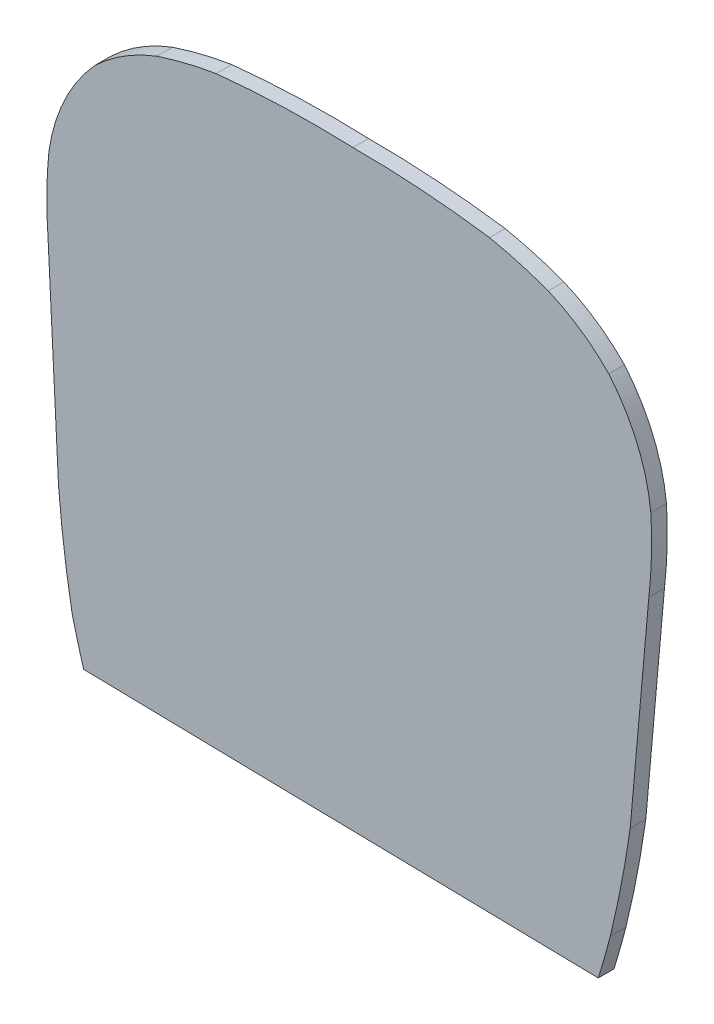
ISO-10303-21;
HEADER;
FILE_DESCRIPTION(('STEP AP214'),'2;1');
FILE_NAME('part.step','',(''),(''),'','','');
FILE_SCHEMA(('AUTOMOTIVE_DESIGN { 1 0 10303 214 1 1 1 1 }'));
ENDSEC;
DATA;
#1=APPLICATION_CONTEXT('core data for automotive mechanical design processes');
#2=APPLICATION_PROTOCOL_DEFINITION('international standard','automotive_design',2000,#1);
#3=PRODUCT_CONTEXT('',#1,'mechanical');
#4=PRODUCT('Part','Part','',(#3));
#5=PRODUCT_RELATED_PRODUCT_CATEGORY('part','',(#4));
#6=PRODUCT_DEFINITION_FORMATION('','',#4);
#7=PRODUCT_DEFINITION_CONTEXT('part definition',#1,'design');
#8=PRODUCT_DEFINITION('design','',#6,#7);
#9=PRODUCT_DEFINITION_SHAPE('','',#8);
#10=(LENGTH_UNIT() NAMED_UNIT(*) SI_UNIT(.MILLI.,.METRE.));
#11=(NAMED_UNIT(*) PLANE_ANGLE_UNIT() SI_UNIT($,.RADIAN.));
#12=(NAMED_UNIT(*) SI_UNIT($,.STERADIAN.) SOLID_ANGLE_UNIT());
#13=UNCERTAINTY_MEASURE_WITH_UNIT(LENGTH_MEASURE(1.E-05),#10,'distance_accuracy_value','');
#14=(GEOMETRIC_REPRESENTATION_CONTEXT(3) GLOBAL_UNCERTAINTY_ASSIGNED_CONTEXT((#13)) GLOBAL_UNIT_ASSIGNED_CONTEXT((#10,
#11,#12)) REPRESENTATION_CONTEXT('',''));
#15=CARTESIAN_POINT('',(0.,0.,0.));
#16=DIRECTION('',(0.,0.,1.));
#17=DIRECTION('',(1.,0.,0.));
#18=AXIS2_PLACEMENT_3D('',#15,#16,#17);
#19=CARTESIAN_POINT('',(-5.67417224383373,6.99934325123754,45.8150965279296));
#20=DIRECTION('',(0.,0.,1.));
#21=DIRECTION('',(-0.999812677663925,0.0193548335692306,0.));
#22=AXIS2_PLACEMENT_3D('',#19,#20,#21);
#23=PLANE('',#22);
#24=CARTESIAN_POINT('',(0.530056286970287,1.01824527478446,45.8150965279299));
#25=DIRECTION('',(0.,0.,-1.));
#26=DIRECTION('',(0.999812677663925,-0.0193548335692306,0.));
#27=AXIS2_PLACEMENT_3D('',#24,#25,#26);
#28=CIRCLE('',#27,12.0325225140272);
#29=CARTESIAN_POINT('',(2.90017532436274,12.8150301672525,45.8150965279298));
#30=VERTEX_POINT('',#29);
#31=CARTESIAN_POINT('',(4.78161682306448,12.2746137415013,45.8150965279299));
#32=VERTEX_POINT('',#31);
#33=EDGE_CURVE('E252',#30,#32,#28,.T.);
#34=ORIENTED_EDGE('',*,*,#33,.F.);
#35=CARTESIAN_POINT('',(-1.48641653317343,-17.9871033769043,45.8150965279301));
#36=DIRECTION('',(0.,0.,-1.));
#37=DIRECTION('',(0.999812677663925,-0.0193548335692306,0.));
#38=AXIS2_PLACEMENT_3D('',#35,#36,#37);
#39=CIRCLE('',#38,31.1129172370042);
#40=CARTESIAN_POINT('',(-1.47338446078643,13.1258111307685,45.8150965279297));
#41=VERTEX_POINT('',#40);
#42=EDGE_CURVE('E247',#41,#30,#39,.T.);
#43=ORIENTED_EDGE('',*,*,#42,.F.);
#44=CARTESIAN_POINT('',(-2.66450711215649,-17.9642973237393,45.8150965279301));
#45=DIRECTION('',(0.,0.,-1.));
#46=DIRECTION('',(0.999812677663925,-0.0193548335692306,0.));
#47=AXIS2_PLACEMENT_3D('',#44,#45,#46);
#48=CIRCLE('',#47,31.1129172030472);
#49=CARTESIAN_POINT('',(-5.85569546522282,12.9845303403083,45.8150965279296));
#50=VERTEX_POINT('',#49);
#51=EDGE_CURVE('E242',#50,#41,#48,.T.);
#52=ORIENTED_EDGE('',*,*,#51,.F.);
#53=CARTESIAN_POINT('',(-3.94391624226271,1.10485449232203,45.8150965279298));
#54=DIRECTION('',(0.,0.,-1.));
#55=DIRECTION('',(0.999812677663925,-0.0193548335692306,0.));
#56=AXIS2_PLACEMENT_3D('',#53,#54,#55);
#57=CIRCLE('',#56,12.0325225140272);
#58=CARTESIAN_POINT('',(-7.75664277320113,12.5173351363735,45.8150965279295));
#59=VERTEX_POINT('',#58);
#60=EDGE_CURVE('E237',#59,#50,#57,.T.);
#61=ORIENTED_EDGE('',*,*,#60,.F.);
#62=CARTESIAN_POINT('',(-5.67417224383373,6.99934325123754,45.8150965279296));
#63=DIRECTION('',(0.,0.,-1.));
#64=DIRECTION('',(0.999812677663925,-0.0193548335692306,0.));
#65=AXIS2_PLACEMENT_3D('',#62,#63,#64);
#66=CIRCLE('',#65,5.8978740195184);
#67=CARTESIAN_POINT('',(-9.74550957704439,11.2665590026749,45.8150965279295));
#68=VERTEX_POINT('',#67);
#69=EDGE_CURVE('E232',#68,#59,#66,.T.);
#70=ORIENTED_EDGE('',*,*,#69,.F.);
#71=CARTESIAN_POINT('',(-5.42512198701847,7.3272075898744,45.8150965279296));
#72=DIRECTION('',(0.,0.,-1.));
#73=DIRECTION('',(0.999812677663925,-0.0193548335692306,0.));
#74=AXIS2_PLACEMENT_3D('',#71,#72,#73);
#75=CIRCLE('',#74,5.846728870196);
#76=CARTESIAN_POINT('',(-11.2152036833306,8.13911425422368,45.8150965279295));
#77=VERTEX_POINT('',#76);
#78=EDGE_CURVE('E227',#77,#68,#75,.T.);
#79=ORIENTED_EDGE('',*,*,#78,.F.);
#80=CARTESIAN_POINT('',(2.30368448001543,6.79226722780302,45.8150965279299));
#81=DIRECTION('',(0.,0.,-1.));
#82=DIRECTION('',(0.999812677663925,-0.0193548335692306,0.));
#83=AXIS2_PLACEMENT_3D('',#80,#81,#82);
#84=CIRCLE('',#83,13.5858137071592);
#85=CARTESIAN_POINT('',(-11.2430688844002,5.76279776767875,45.8150965279295));
#86=VERTEX_POINT('',#85);
#87=EDGE_CURVE('E136',#86,#77,#84,.T.);
#88=ORIENTED_EDGE('',*,*,#87,.F.);
#89=DIRECTION('',(0.0500831809567751,-0.998745050042928,0.));
#90=VECTOR('',#89,1.);
#91=CARTESIAN_POINT('',(-10.9057934577918,-0.963056229434312,45.8150965279296));
#92=LINE('',#91,#90);
#93=CARTESIAN_POINT('',(-10.9057934577918,-0.963056229434231,45.8150965279296));
#94=VERTEX_POINT('',#93);
#95=EDGE_CURVE('E135',#94,#86,#92,.F.);
#96=ORIENTED_EDGE('',*,*,#95,.F.);
#97=CARTESIAN_POINT('',(22.6796627220154,1.7211664776255,45.8150965279306));
#98=DIRECTION('',(0.,0.,-1.));
#99=DIRECTION('',(0.999812677663925,-0.0193548335692306,0.));
#100=AXIS2_PLACEMENT_3D('',#97,#98,#99);
#101=CIRCLE('',#100,33.6925498938096);
#102=CARTESIAN_POINT('',(-10.4707169958812,-4.29882047469555,45.8150965279296));
#103=VERTEX_POINT('',#102);
#104=EDGE_CURVE('E20',#103,#94,#101,.T.);
#105=ORIENTED_EDGE('',*,*,#104,.F.);
#106=CARTESIAN_POINT('',(17.1662588400598,2.46523412556552,45.8150965279304));
#107=DIRECTION('',(0.,0.,-1.));
#108=DIRECTION('',(0.999812677663925,-0.0193548335692306,0.));
#109=AXIS2_PLACEMENT_3D('',#106,#107,#108);
#110=CIRCLE('',#109,28.4526776945808);
#111=CARTESIAN_POINT('',(-10.1003556820076,-5.6641324239686,45.8150965279297));
#112=VERTEX_POINT('',#111);
#113=EDGE_CURVE('E278',#112,#103,#110,.T.);
#114=ORIENTED_EDGE('',*,*,#113,.F.);
#115=DIRECTION('',(0.999812677663925,-0.0193548335692306,0.));
#116=VECTOR('',#115,1.);
#117=CARTESIAN_POINT('',(6.38510731119488,-5.98326559728529,45.8150965279302));
#118=LINE('',#117,#116);
#119=CARTESIAN_POINT('',(6.38510731119487,-5.98326559728529,45.8150965279302));
#120=VERTEX_POINT('',#119);
#121=EDGE_CURVE('E168',#120,#112,#118,.F.);
#122=ORIENTED_EDGE('',*,*,#121,.F.);
#123=CARTESIAN_POINT('',(-20.7843012620732,2.46529083387636,45.8150965279292));
#124=DIRECTION('',(0.,0.,-1.));
#125=DIRECTION('',(0.999812677663925,-0.0193548335692306,0.));
#126=AXIS2_PLACEMENT_3D('',#123,#124,#125);
#127=CIRCLE('',#126,28.4526776945808);
#128=CARTESIAN_POINT('',(6.76871470810026,-4.63303142839532,45.8150965279302));
#129=VERTEX_POINT('',#128);
#130=EDGE_CURVE('E275',#129,#120,#127,.T.);
#131=ORIENTED_EDGE('',*,*,#130,.F.);
#132=CARTESIAN_POINT('',(-25.9566044322497,3.38204221500296,45.8150965279291));
#133=DIRECTION('',(0.,0.,-1.));
#134=DIRECTION('',(0.999812677663925,-0.0193548335692306,0.));
#135=AXIS2_PLACEMENT_3D('',#132,#133,#134);
#136=CIRCLE('',#135,33.6925498938096);
#137=CARTESIAN_POINT('',(7.40687411566913,-1.31542705359407,45.8150965279302));
#138=VERTEX_POINT('',#137);
#139=EDGE_CURVE('E270',#138,#129,#136,.T.);
#140=ORIENTED_EDGE('',*,*,#139,.F.);
#141=DIRECTION('',(0.0886995040357044,0.996058431008854,0.));
#142=VECTOR('',#141,1.);
#143=CARTESIAN_POINT('',(8.00401392218934,5.39020388810814,45.8150965279301));
#144=LINE('',#143,#142);
#145=CARTESIAN_POINT('',(8.00401392218934,5.39020388810806,45.8150965279301));
#146=VERTEX_POINT('',#145);
#147=EDGE_CURVE('E162',#146,#138,#144,.F.);
#148=ORIENTED_EDGE('',*,*,#147,.F.);
#149=CARTESIAN_POINT('',(-5.49274699972552,6.94319413350787,45.8150965279296));
#150=DIRECTION('',(0.,0.,-1.));
#151=DIRECTION('',(0.999812677663925,-0.0193548335692306,0.));
#152=AXIS2_PLACEMENT_3D('',#149,#150,#151);
#153=CIRCLE('',#152,13.5858137071592);
#154=CARTESIAN_POINT('',(8.06813878736105,7.76581844340164,45.8150965279301));
#155=VERTEX_POINT('',#154);
#156=EDGE_CURVE('E267',#155,#146,#153,.T.);
#157=ORIENTED_EDGE('',*,*,#156,.F.);
#158=CARTESIAN_POINT('',(2.25097238178384,7.17861022529906,45.8150965279299));
#159=DIRECTION('',(0.,0.,-1.));
#160=DIRECTION('',(0.999812677663925,-0.0193548335692306,0.));
#161=AXIS2_PLACEMENT_3D('',#158,#159,#160);
#162=CIRCLE('',#161,5.846728870196);
#163=CARTESIAN_POINT('',(6.72058547159109,10.9478007629354,45.81509652793));
#164=VERTEX_POINT('',#163);
#165=EDGE_CURVE('E262',#164,#155,#162,.T.);
#166=ORIENTED_EDGE('',*,*,#165,.F.);
#167=CARTESIAN_POINT('',(2.48714690336352,6.84135268227571,45.8150965279299));
#168=DIRECTION('',(0.,0.,-1.));
#169=DIRECTION('',(0.999812677663925,-0.0193548335692306,0.));
#170=AXIS2_PLACEMENT_3D('',#167,#168,#169);
#171=CIRCLE('',#170,5.8978740195184);
#172=EDGE_CURVE('E257',#32,#164,#171,.T.);
#173=ORIENTED_EDGE('',*,*,#172,.F.);
#174=EDGE_LOOP('',(#34,#43,#52,#61,#70,#79,#88,#96,#105,#114,#122,#131,#140,#148,#157,#166,#173));
#175=FACE_BOUND('',#174,.T.);
#176=ADVANCED_FACE('F17',(#175),#23,.T.);
#177=CARTESIAN_POINT('',(-10.9057934577918,-0.963056229434297,46.8472492910314));
#178=DIRECTION('',(-0.998745050042928,-0.0500831809567751,0.));
#179=DIRECTION('',(0.0500831809567751,-0.998745050042928,0.));
#180=AXIS2_PLACEMENT_3D('',#177,#178,#179);
#181=PLANE('',#180);
#182=DIRECTION('',(0.,0.,-1.));
#183=VECTOR('',#182,1.);
#184=CARTESIAN_POINT('',(-10.9057934577918,-0.963056229434226,46.8472492910314));
#185=LINE('',#184,#183);
#186=CARTESIAN_POINT('',(-10.9057934577918,-0.963056229434252,45.3140965279296));
#187=VERTEX_POINT('',#186);
#188=EDGE_CURVE('E142',#94,#187,#185,.T.);
#189=ORIENTED_EDGE('',*,*,#188,.F.);
#190=ORIENTED_EDGE('',*,*,#95,.T.);
#191=DIRECTION('',(0.,0.,-1.));
#192=VECTOR('',#191,1.);
#193=CARTESIAN_POINT('',(-11.2430688844002,5.76279776767878,46.8472492910314));
#194=LINE('',#193,#192);
#195=CARTESIAN_POINT('',(-11.2430688844002,5.76279776767882,45.3140965279295));
#196=VERTEX_POINT('',#195);
#197=EDGE_CURVE('E226',#196,#86,#194,.F.);
#198=ORIENTED_EDGE('',*,*,#197,.F.);
#199=DIRECTION('',(0.050083180956776,-0.998745050042928,0.));
#200=VECTOR('',#199,1.);
#201=CARTESIAN_POINT('',(-11.2430688844002,5.76279776767876,45.3140965279295));
#202=LINE('',#201,#200);
#203=EDGE_CURVE('E154',#196,#187,#202,.T.);
#204=ORIENTED_EDGE('',*,*,#203,.T.);
#205=EDGE_LOOP('',(#189,#190,#198,#204));
#206=FACE_BOUND('',#205,.T.);
#207=ADVANCED_FACE('F152',(#206),#181,.T.);
#208=CARTESIAN_POINT('',(22.6796627220154,1.72116647762551,46.8472492910325));
#209=DIRECTION('',(0.,0.,-1.));
#210=DIRECTION('',(0.999812677663925,-0.0193548335692306,0.));
#211=AXIS2_PLACEMENT_3D('',#208,#209,#210);
#212=CYLINDRICAL_SURFACE('',#211,33.6925498938096);
#213=DIRECTION('',(0.,0.,-1.));
#214=VECTOR('',#213,1.);
#215=CARTESIAN_POINT('',(-10.4707169958812,-4.29882047469553,46.8472492910315));
#216=LINE('',#215,#214);
#217=CARTESIAN_POINT('',(-10.4707169958812,-4.29882047469555,45.3140965279297));
#218=VERTEX_POINT('',#217);
#219=EDGE_CURVE('E149',#103,#218,#216,.T.);
#220=ORIENTED_EDGE('',*,*,#219,.F.);
#221=ORIENTED_EDGE('',*,*,#104,.T.);
#222=ORIENTED_EDGE('',*,*,#188,.T.);
#223=CARTESIAN_POINT('',(22.6796627220154,1.72116647762549,45.3140965279306));
#224=DIRECTION('',(0.,0.,-1.));
#225=DIRECTION('',(0.999812677663925,-0.0193548335692306,0.));
#226=AXIS2_PLACEMENT_3D('',#223,#224,#225);
#227=CIRCLE('',#226,33.6925498938096);
#228=EDGE_CURVE('E221',#187,#218,#227,.F.);
#229=ORIENTED_EDGE('',*,*,#228,.T.);
#230=EDGE_LOOP('',(#220,#221,#222,#229));
#231=FACE_BOUND('',#230,.T.);
#232=ADVANCED_FACE('F146',(#231),#212,.T.);
#233=CARTESIAN_POINT('',(17.1662588400597,2.46523412556554,46.8472492910323));
#234=DIRECTION('',(0.,0.,-1.));
#235=DIRECTION('',(0.999812677663925,-0.0193548335692306,0.));
#236=AXIS2_PLACEMENT_3D('',#233,#234,#235);
#237=CYLINDRICAL_SURFACE('',#236,28.4526776945808);
#238=DIRECTION('',(0.,0.,1.));
#239=VECTOR('',#238,1.);
#240=CARTESIAN_POINT('',(-10.1003556820076,-5.66413242396858,46.8472492910315));
#241=LINE('',#240,#239);
#242=CARTESIAN_POINT('',(-10.1003556820075,-5.66413242396861,45.3140965279297));
#243=VERTEX_POINT('',#242);
#244=EDGE_CURVE('E172',#112,#243,#241,.F.);
#245=ORIENTED_EDGE('',*,*,#244,.F.);
#246=ORIENTED_EDGE('',*,*,#113,.T.);
#247=ORIENTED_EDGE('',*,*,#219,.T.);
#248=CARTESIAN_POINT('',(17.1662588400598,2.46523412556551,45.3140965279305));
#249=DIRECTION('',(0.,0.,-1.));
#250=DIRECTION('',(0.999812677663925,-0.0193548335692306,0.));
#251=AXIS2_PLACEMENT_3D('',#248,#249,#250);
#252=CIRCLE('',#251,28.4526776945808);
#253=EDGE_CURVE('E217',#218,#243,#252,.F.);
#254=ORIENTED_EDGE('',*,*,#253,.T.);
#255=EDGE_LOOP('',(#245,#246,#247,#254));
#256=FACE_BOUND('',#255,.T.);
#257=ADVANCED_FACE('F287',(#256),#237,.T.);
#258=CARTESIAN_POINT('',(6.38510731119485,-5.98326559728527,46.8472492910321));
#259=DIRECTION('',(-0.0193548335692306,-0.999812677663925,0.));
#260=DIRECTION('',(0.999812677663925,-0.0193548335692306,0.));
#261=AXIS2_PLACEMENT_3D('',#258,#259,#260);
#262=PLANE('',#261);
#263=DIRECTION('',(0.,0.,-1.));
#264=VECTOR('',#263,1.);
#265=CARTESIAN_POINT('',(6.38510731119484,-5.98326559728527,46.8472492910321));
#266=LINE('',#265,#264);
#267=CARTESIAN_POINT('',(6.38510731119489,-5.98326559728529,45.3140965279302));
#268=VERTEX_POINT('',#267);
#269=EDGE_CURVE('E171',#120,#268,#266,.T.);
#270=ORIENTED_EDGE('',*,*,#269,.F.);
#271=ORIENTED_EDGE('',*,*,#121,.T.);
#272=ORIENTED_EDGE('',*,*,#244,.T.);
#273=DIRECTION('',(-0.999812677663925,0.0193548335692306,0.));
#274=VECTOR('',#273,1.);
#275=CARTESIAN_POINT('',(-2.42926960316287,-5.81263283576393,45.3140965279299));
#276=LINE('',#275,#274);
#277=EDGE_CURVE('E216',#243,#268,#276,.F.);
#278=ORIENTED_EDGE('',*,*,#277,.T.);
#279=EDGE_LOOP('',(#270,#271,#272,#278));
#280=FACE_BOUND('',#279,.T.);
#281=ADVANCED_FACE('F332',(#280),#262,.T.);
#282=CARTESIAN_POINT('',(-20.7843012620732,2.46529083387637,46.8472492910311));
#283=DIRECTION('',(0.,0.,-1.));
#284=DIRECTION('',(0.999812677663925,-0.0193548335692306,0.));
#285=AXIS2_PLACEMENT_3D('',#282,#283,#284);
#286=CYLINDRICAL_SURFACE('',#285,28.4526776945808);
#287=DIRECTION('',(0.,0.,-1.));
#288=VECTOR('',#287,1.);
#289=CARTESIAN_POINT('',(6.76871470810022,-4.63303142839535,46.8472492910321));
#290=LINE('',#289,#288);
#291=CARTESIAN_POINT('',(6.76871470810029,-4.63303142839528,45.3140965279302));
#292=VERTEX_POINT('',#291);
#293=EDGE_CURVE('E274',#129,#292,#290,.T.);
#294=ORIENTED_EDGE('',*,*,#293,.F.);
#295=ORIENTED_EDGE('',*,*,#130,.T.);
#296=ORIENTED_EDGE('',*,*,#269,.T.);
#297=CARTESIAN_POINT('',(-20.7843012620732,2.46529083387635,45.3140965279292));
#298=DIRECTION('',(0.,0.,-1.));
#299=DIRECTION('',(0.999812677663925,-0.0193548335692306,0.));
#300=AXIS2_PLACEMENT_3D('',#297,#298,#299);
#301=CIRCLE('',#300,28.4526776945808);
#302=EDGE_CURVE('E212',#268,#292,#301,.F.);
#303=ORIENTED_EDGE('',*,*,#302,.T.);
#304=EDGE_LOOP('',(#294,#295,#296,#303));
#305=FACE_BOUND('',#304,.T.);
#306=ADVANCED_FACE('F331',(#305),#286,.T.);
#307=CARTESIAN_POINT('',(-25.9566044322497,3.38204221500297,46.8472492910309));
#308=DIRECTION('',(0.,0.,-1.));
#309=DIRECTION('',(0.999812677663925,-0.0193548335692306,0.));
#310=AXIS2_PLACEMENT_3D('',#307,#308,#309);
#311=CYLINDRICAL_SURFACE('',#310,33.6925498938096);
#312=DIRECTION('',(0.,0.,1.));
#313=VECTOR('',#312,1.);
#314=CARTESIAN_POINT('',(7.40687411566909,-1.31542705359407,46.847249291032));
#315=LINE('',#314,#313);
#316=CARTESIAN_POINT('',(7.40687411566913,-1.31542705359414,45.3140965279302));
#317=VERTEX_POINT('',#316);
#318=EDGE_CURVE('E167',#138,#317,#315,.F.);
#319=ORIENTED_EDGE('',*,*,#318,.F.);
#320=ORIENTED_EDGE('',*,*,#139,.T.);
#321=ORIENTED_EDGE('',*,*,#293,.T.);
#322=CARTESIAN_POINT('',(-25.9566044322497,3.38204221500295,45.3140965279291));
#323=DIRECTION('',(0.,0.,-1.));
#324=DIRECTION('',(0.999812677663925,-0.0193548335692306,0.));
#325=AXIS2_PLACEMENT_3D('',#322,#323,#324);
#326=CIRCLE('',#325,33.6925498938096);
#327=EDGE_CURVE('E208',#292,#317,#326,.F.);
#328=ORIENTED_EDGE('',*,*,#327,.T.);
#329=EDGE_LOOP('',(#319,#320,#321,#328));
#330=FACE_BOUND('',#329,.T.);
#331=ADVANCED_FACE('F336',(#330),#311,.T.);
#332=CARTESIAN_POINT('',(8.00401392218931,5.39020388810815,46.847249291032));
#333=DIRECTION('',(0.996058431008854,-0.0886995040357044,0.));
#334=DIRECTION('',(0.0886995040357044,0.996058431008854,0.));
#335=AXIS2_PLACEMENT_3D('',#332,#333,#334);
#336=PLANE('',#335);
#337=DIRECTION('',(0.,0.,-1.));
#338=VECTOR('',#337,1.);
#339=CARTESIAN_POINT('',(8.00401392218931,5.39020388810814,46.847249291032));
#340=LINE('',#339,#338);
#341=CARTESIAN_POINT('',(8.00401392218936,5.3902038881081,45.3140965279301));
#342=VERTEX_POINT('',#341);
#343=EDGE_CURVE('E166',#146,#342,#340,.T.);
#344=ORIENTED_EDGE('',*,*,#343,.F.);
#345=ORIENTED_EDGE('',*,*,#147,.T.);
#346=ORIENTED_EDGE('',*,*,#318,.T.);
#347=DIRECTION('',(0.0886995040357049,0.996058431008854,0.));
#348=VECTOR('',#347,1.);
#349=CARTESIAN_POINT('',(7.40687411566913,-1.31542705359416,45.3140965279302));
#350=LINE('',#349,#348);
#351=EDGE_CURVE('E207',#317,#342,#350,.T.);
#352=ORIENTED_EDGE('',*,*,#351,.T.);
#353=EDGE_LOOP('',(#344,#345,#346,#352));
#354=FACE_BOUND('',#353,.T.);
#355=ADVANCED_FACE('F341',(#354),#336,.T.);
#356=CARTESIAN_POINT('',(-5.49274699972555,6.94319413350788,46.8472492910315));
#357=DIRECTION('',(0.,0.,-1.));
#358=DIRECTION('',(0.999812677663925,-0.0193548335692306,0.));
#359=AXIS2_PLACEMENT_3D('',#356,#357,#358);
#360=CYLINDRICAL_SURFACE('',#359,13.5858137071592);
#361=CARTESIAN_POINT('',(-5.4927469997255,6.94319413350786,45.3140965279297));
#362=DIRECTION('',(0.,0.,-1.));
#363=DIRECTION('',(0.999812677663925,-0.0193548335692306,0.));
#364=AXIS2_PLACEMENT_3D('',#361,#362,#363);
#365=CIRCLE('',#364,13.5858137071592);
#366=CARTESIAN_POINT('',(8.06813878736107,7.76581844340164,45.3140965279301));
#367=VERTEX_POINT('',#366);
#368=EDGE_CURVE('E204',#342,#367,#365,.F.);
#369=ORIENTED_EDGE('',*,*,#368,.T.);
#370=DIRECTION('',(0.,0.,-1.));
#371=VECTOR('',#370,1.);
#372=CARTESIAN_POINT('',(8.06813878736102,7.76581844340167,46.8472492910319));
#373=LINE('',#372,#371);
#374=EDGE_CURVE('E266',#155,#367,#373,.T.);
#375=ORIENTED_EDGE('',*,*,#374,.F.);
#376=ORIENTED_EDGE('',*,*,#156,.T.);
#377=ORIENTED_EDGE('',*,*,#343,.T.);
#378=EDGE_LOOP('',(#369,#375,#376,#377));
#379=FACE_BOUND('',#378,.T.);
#380=ADVANCED_FACE('F350',(#379),#360,.T.);
#381=CARTESIAN_POINT('',(2.2509723817838,7.17861022529908,46.8472492910318));
#382=DIRECTION('',(0.,0.,-1.));
#383=DIRECTION('',(0.999812677663925,-0.0193548335692306,0.));
#384=AXIS2_PLACEMENT_3D('',#381,#382,#383);
#385=CYLINDRICAL_SURFACE('',#384,5.846728870196);
#386=DIRECTION('',(0.,0.,-1.));
#387=VECTOR('',#386,1.);
#388=CARTESIAN_POINT('',(6.72058547159106,10.9478007629354,46.8472492910318));
#389=LINE('',#388,#387);
#390=CARTESIAN_POINT('',(6.72058547159111,10.9478007629353,45.31409652793));
#391=VERTEX_POINT('',#390);
#392=EDGE_CURVE('E261',#164,#391,#389,.T.);
#393=ORIENTED_EDGE('',*,*,#392,.F.);
#394=ORIENTED_EDGE('',*,*,#165,.T.);
#395=ORIENTED_EDGE('',*,*,#374,.T.);
#396=CARTESIAN_POINT('',(2.25097238178385,7.17861022529905,45.3140965279299));
#397=DIRECTION('',(0.,0.,-1.));
#398=DIRECTION('',(0.999812677663925,-0.0193548335692306,0.));
#399=AXIS2_PLACEMENT_3D('',#396,#397,#398);
#400=CIRCLE('',#399,5.846728870196);
#401=EDGE_CURVE('E200',#367,#391,#400,.F.);
#402=ORIENTED_EDGE('',*,*,#401,.T.);
#403=EDGE_LOOP('',(#393,#394,#395,#402));
#404=FACE_BOUND('',#403,.T.);
#405=ADVANCED_FACE('F353',(#404),#385,.T.);
#406=CARTESIAN_POINT('',(2.48714690336348,6.84135268227572,46.8472492910318));
#407=DIRECTION('',(0.,0.,-1.));
#408=DIRECTION('',(0.999812677663925,-0.0193548335692306,0.));
#409=AXIS2_PLACEMENT_3D('',#406,#407,#408);
#410=CYLINDRICAL_SURFACE('',#409,5.8978740195184);
#411=DIRECTION('',(0.,0.,-1.));
#412=VECTOR('',#411,1.);
#413=CARTESIAN_POINT('',(4.78161682306445,12.2746137415013,46.8472492910318));
#414=LINE('',#413,#412);
#415=CARTESIAN_POINT('',(4.78161682306451,12.2746137415013,45.3140965279299));
#416=VERTEX_POINT('',#415);
#417=EDGE_CURVE('E256',#32,#416,#414,.T.);
#418=ORIENTED_EDGE('',*,*,#417,.F.);
#419=ORIENTED_EDGE('',*,*,#172,.T.);
#420=ORIENTED_EDGE('',*,*,#392,.T.);
#421=CARTESIAN_POINT('',(2.48714690336353,6.8413526822757,45.3140965279299));
#422=DIRECTION('',(0.,0.,-1.));
#423=DIRECTION('',(0.999812677663925,-0.0193548335692306,0.));
#424=AXIS2_PLACEMENT_3D('',#421,#422,#423);
#425=CIRCLE('',#424,5.8978740195184);
#426=EDGE_CURVE('E196',#391,#416,#425,.F.);
#427=ORIENTED_EDGE('',*,*,#426,.T.);
#428=EDGE_LOOP('',(#418,#419,#420,#427));
#429=FACE_BOUND('',#428,.T.);
#430=ADVANCED_FACE('F356',(#429),#410,.T.);
#431=CARTESIAN_POINT('',(0.530056286970254,1.01824527478447,46.8472492910318));
#432=DIRECTION('',(0.,0.,-1.));
#433=DIRECTION('',(0.999812677663925,-0.0193548335692306,0.));
#434=AXIS2_PLACEMENT_3D('',#431,#432,#433);
#435=CYLINDRICAL_SURFACE('',#434,12.0325225140272);
#436=DIRECTION('',(0.,0.,-1.));
#437=VECTOR('',#436,1.);
#438=CARTESIAN_POINT('',(2.90017532436272,12.8150301672525,46.8472492910317));
#439=LINE('',#438,#437);
#440=CARTESIAN_POINT('',(2.90017532436274,12.8150301672525,45.3140965279298));
#441=VERTEX_POINT('',#440);
#442=EDGE_CURVE('E251',#30,#441,#439,.T.);
#443=ORIENTED_EDGE('',*,*,#442,.F.);
#444=ORIENTED_EDGE('',*,*,#33,.T.);
#445=ORIENTED_EDGE('',*,*,#417,.T.);
#446=CARTESIAN_POINT('',(0.530056286970303,1.01824527478445,45.3140965279299));
#447=DIRECTION('',(0.,0.,-1.));
#448=DIRECTION('',(0.999812677663925,-0.0193548335692306,0.));
#449=AXIS2_PLACEMENT_3D('',#446,#447,#448);
#450=CIRCLE('',#449,12.0325225140272);
#451=EDGE_CURVE('E192',#416,#441,#450,.F.);
#452=ORIENTED_EDGE('',*,*,#451,.T.);
#453=EDGE_LOOP('',(#443,#444,#445,#452));
#454=FACE_BOUND('',#453,.T.);
#455=ADVANCED_FACE('F360',(#454),#435,.T.);
#456=CARTESIAN_POINT('',(-1.48641653317347,-17.9871033769043,46.847249291032));
#457=DIRECTION('',(0.,0.,-1.));
#458=DIRECTION('',(0.999812677663925,-0.0193548335692306,0.));
#459=AXIS2_PLACEMENT_3D('',#456,#457,#458);
#460=CYLINDRICAL_SURFACE('',#459,31.1129172370042);
#461=DIRECTION('',(0.,0.,-1.));
#462=VECTOR('',#461,1.);
#463=CARTESIAN_POINT('',(-1.47338446078647,13.1258111307686,46.8472492910316));
#464=LINE('',#463,#462);
#465=CARTESIAN_POINT('',(-1.47338446078642,13.1258111307685,45.3140965279297));
#466=VERTEX_POINT('',#465);
#467=EDGE_CURVE('E246',#41,#466,#464,.T.);
#468=ORIENTED_EDGE('',*,*,#467,.F.);
#469=ORIENTED_EDGE('',*,*,#42,.T.);
#470=ORIENTED_EDGE('',*,*,#442,.T.);
#471=CARTESIAN_POINT('',(-1.48641653317342,-17.9871033769043,45.3140965279301));
#472=DIRECTION('',(0.,0.,-1.));
#473=DIRECTION('',(0.999812677663925,-0.0193548335692306,0.));
#474=AXIS2_PLACEMENT_3D('',#471,#472,#473);
#475=CIRCLE('',#474,31.1129172370042);
#476=EDGE_CURVE('E189',#441,#466,#475,.F.);
#477=ORIENTED_EDGE('',*,*,#476,.T.);
#478=EDGE_LOOP('',(#468,#469,#470,#477));
#479=FACE_BOUND('',#478,.T.);
#480=ADVANCED_FACE('F366',(#479),#460,.T.);
#481=CARTESIAN_POINT('',(-2.66450711215652,-17.9642973237393,46.8472492910319));
#482=DIRECTION('',(0.,0.,-1.));
#483=DIRECTION('',(0.999812677663925,-0.0193548335692306,0.));
#484=AXIS2_PLACEMENT_3D('',#481,#482,#483);
#485=CYLINDRICAL_SURFACE('',#484,31.1129172030472);
#486=DIRECTION('',(0.,0.,-1.));
#487=VECTOR('',#486,1.);
#488=CARTESIAN_POINT('',(-5.85569546522287,12.9845303403084,46.8472492910314));
#489=LINE('',#488,#487);
#490=CARTESIAN_POINT('',(-5.85569546522282,12.9845303403083,45.3140965279296));
#491=VERTEX_POINT('',#490);
#492=EDGE_CURVE('E241',#50,#491,#489,.T.);
#493=ORIENTED_EDGE('',*,*,#492,.F.);
#494=ORIENTED_EDGE('',*,*,#51,.T.);
#495=ORIENTED_EDGE('',*,*,#467,.T.);
#496=CARTESIAN_POINT('',(-2.66450711215648,-17.9642973237393,45.3140965279301));
#497=DIRECTION('',(0.,0.,-1.));
#498=DIRECTION('',(0.999812677663925,-0.0193548335692306,0.));
#499=AXIS2_PLACEMENT_3D('',#496,#497,#498);
#500=CIRCLE('',#499,31.1129172030472);
#501=EDGE_CURVE('E185',#466,#491,#500,.F.);
#502=ORIENTED_EDGE('',*,*,#501,.T.);
#503=EDGE_LOOP('',(#493,#494,#495,#502));
#504=FACE_BOUND('',#503,.T.);
#505=ADVANCED_FACE('F369',(#504),#485,.T.);
#506=CARTESIAN_POINT('',(-3.94391624226274,1.10485449232204,46.8472492910316));
#507=DIRECTION('',(0.,0.,-1.));
#508=DIRECTION('',(0.999812677663925,-0.0193548335692306,0.));
#509=AXIS2_PLACEMENT_3D('',#506,#507,#508);
#510=CYLINDRICAL_SURFACE('',#509,12.0325225140272);
#511=DIRECTION('',(0.,0.,-1.));
#512=VECTOR('',#511,1.);
#513=CARTESIAN_POINT('',(-7.75664277320116,12.5173351363735,46.8472492910314));
#514=LINE('',#513,#512);
#515=CARTESIAN_POINT('',(-7.75664277320111,12.5173351363735,45.3140965279295));
#516=VERTEX_POINT('',#515);
#517=EDGE_CURVE('E236',#59,#516,#514,.T.);
#518=ORIENTED_EDGE('',*,*,#517,.F.);
#519=ORIENTED_EDGE('',*,*,#60,.T.);
#520=ORIENTED_EDGE('',*,*,#492,.T.);
#521=CARTESIAN_POINT('',(-3.9439162422627,1.10485449232202,45.3140965279298));
#522=DIRECTION('',(0.,0.,-1.));
#523=DIRECTION('',(0.999812677663925,-0.0193548335692306,0.));
#524=AXIS2_PLACEMENT_3D('',#521,#522,#523);
#525=CIRCLE('',#524,12.0325225140272);
#526=EDGE_CURVE('E181',#491,#516,#525,.F.);
#527=ORIENTED_EDGE('',*,*,#526,.T.);
#528=EDGE_LOOP('',(#518,#519,#520,#527));
#529=FACE_BOUND('',#528,.T.);
#530=ADVANCED_FACE('F372',(#529),#510,.T.);
#531=CARTESIAN_POINT('',(-5.67417224383376,6.99934325123756,46.8472492910315));
#532=DIRECTION('',(0.,0.,-1.));
#533=DIRECTION('',(0.999812677663925,-0.0193548335692306,0.));
#534=AXIS2_PLACEMENT_3D('',#531,#532,#533);
#535=CYLINDRICAL_SURFACE('',#534,5.8978740195184);
#536=DIRECTION('',(0.,0.,-1.));
#537=VECTOR('',#536,1.);
#538=CARTESIAN_POINT('',(-9.74550957704442,11.2665590026749,46.8472492910313));
#539=LINE('',#538,#537);
#540=CARTESIAN_POINT('',(-9.74550957704437,11.2665590026749,45.3140965279295));
#541=VERTEX_POINT('',#540);
#542=EDGE_CURVE('E231',#68,#541,#539,.T.);
#543=ORIENTED_EDGE('',*,*,#542,.F.);
#544=ORIENTED_EDGE('',*,*,#69,.T.);
#545=ORIENTED_EDGE('',*,*,#517,.T.);
#546=CARTESIAN_POINT('',(-5.67417224383371,6.99934325123754,45.3140965279296));
#547=DIRECTION('',(0.,0.,-1.));
#548=DIRECTION('',(0.999812677663925,-0.0193548335692306,0.));
#549=AXIS2_PLACEMENT_3D('',#546,#547,#548);
#550=CIRCLE('',#549,5.8978740195184);
#551=EDGE_CURVE('E177',#516,#541,#550,.F.);
#552=ORIENTED_EDGE('',*,*,#551,.T.);
#553=EDGE_LOOP('',(#543,#544,#545,#552));
#554=FACE_BOUND('',#553,.T.);
#555=ADVANCED_FACE('F376',(#554),#535,.T.);
#556=CARTESIAN_POINT('',(-5.4251219870185,7.32720758987442,46.8472492910315));
#557=DIRECTION('',(0.,0.,-1.));
#558=DIRECTION('',(0.999812677663925,-0.0193548335692306,0.));
#559=AXIS2_PLACEMENT_3D('',#556,#557,#558);
#560=CYLINDRICAL_SURFACE('',#559,5.846728870196);
#561=DIRECTION('',(0.,0.,-1.));
#562=VECTOR('',#561,1.);
#563=CARTESIAN_POINT('',(-11.2152036833306,8.13911425422368,46.8472492910313));
#564=LINE('',#563,#562);
#565=CARTESIAN_POINT('',(-11.2152036833306,8.13911425422366,45.3140965279295));
#566=VERTEX_POINT('',#565);
#567=EDGE_CURVE('E35',#77,#566,#564,.T.);
#568=ORIENTED_EDGE('',*,*,#567,.F.);
#569=ORIENTED_EDGE('',*,*,#78,.T.);
#570=ORIENTED_EDGE('',*,*,#542,.T.);
#571=CARTESIAN_POINT('',(-5.42512198701845,7.3272075898744,45.3140965279296));
#572=DIRECTION('',(0.,0.,-1.));
#573=DIRECTION('',(0.999812677663925,-0.0193548335692306,0.));
#574=AXIS2_PLACEMENT_3D('',#571,#572,#573);
#575=CIRCLE('',#574,5.846728870196);
#576=EDGE_CURVE('E27',#541,#566,#575,.F.);
#577=ORIENTED_EDGE('',*,*,#576,.T.);
#578=EDGE_LOOP('',(#568,#569,#570,#577));
#579=FACE_BOUND('',#578,.T.);
#580=ADVANCED_FACE('F378',(#579),#560,.T.);
#581=CARTESIAN_POINT('',(2.30368448001539,6.79226722780303,46.8472492910318));
#582=DIRECTION('',(0.,0.,-1.));
#583=DIRECTION('',(0.999812677663925,-0.0193548335692306,0.));
#584=AXIS2_PLACEMENT_3D('',#581,#582,#583);
#585=CYLINDRICAL_SURFACE('',#584,13.5858137071592);
#586=ORIENTED_EDGE('',*,*,#197,.T.);
#587=ORIENTED_EDGE('',*,*,#87,.T.);
#588=ORIENTED_EDGE('',*,*,#567,.T.);
#589=CARTESIAN_POINT('',(2.30368448001544,6.79226722780301,45.3140965279299));
#590=DIRECTION('',(0.,0.,-1.));
#591=DIRECTION('',(0.999812677663925,-0.0193548335692306,0.));
#592=AXIS2_PLACEMENT_3D('',#589,#590,#591);
#593=CIRCLE('',#592,13.5858137071592);
#594=EDGE_CURVE('E11',#566,#196,#593,.F.);
#595=ORIENTED_EDGE('',*,*,#594,.T.);
#596=EDGE_LOOP('',(#586,#587,#588,#595));
#597=FACE_BOUND('',#596,.T.);
#598=ADVANCED_FACE('F380',(#597),#585,.T.);
#599=CARTESIAN_POINT('',(-2.66450711215648,-17.9642973237393,45.3140965279301));
#600=DIRECTION('',(0.,0.,1.));
#601=DIRECTION('',(-0.999812677663925,0.0193548335692306,0.));
#602=AXIS2_PLACEMENT_3D('',#599,#600,#601);
#603=PLANE('',#602);
#604=ORIENTED_EDGE('',*,*,#576,.F.);
#605=ORIENTED_EDGE('',*,*,#551,.F.);
#606=ORIENTED_EDGE('',*,*,#526,.F.);
#607=ORIENTED_EDGE('',*,*,#501,.F.);
#608=ORIENTED_EDGE('',*,*,#476,.F.);
#609=ORIENTED_EDGE('',*,*,#451,.F.);
#610=ORIENTED_EDGE('',*,*,#426,.F.);
#611=ORIENTED_EDGE('',*,*,#401,.F.);
#612=ORIENTED_EDGE('',*,*,#368,.F.);
#613=ORIENTED_EDGE('',*,*,#351,.F.);
#614=ORIENTED_EDGE('',*,*,#327,.F.);
#615=ORIENTED_EDGE('',*,*,#302,.F.);
#616=ORIENTED_EDGE('',*,*,#277,.F.);
#617=ORIENTED_EDGE('',*,*,#253,.F.);
#618=ORIENTED_EDGE('',*,*,#228,.F.);
#619=ORIENTED_EDGE('',*,*,#203,.F.);
#620=ORIENTED_EDGE('',*,*,#594,.F.);
#621=EDGE_LOOP('',(#604,#605,#606,#607,#608,#609,#610,#611,#612,#613,#614,#615,#616,#617,#618,
#619,#620));
#622=FACE_BOUND('',#621,.T.);
#623=ADVANCED_FACE('F291',(#622),#603,.F.);
#624=CLOSED_SHELL('',(#176,#207,#232,#257,#281,#306,#331,#355,#380,#405,#430,#455,#480,#505,
#530,#555,#580,#598,#623));
#625=MANIFOLD_SOLID_BREP('B1',#624);
#626=ADVANCED_BREP_SHAPE_REPRESENTATION('',(#18,#625),#14);
#627=SHAPE_DEFINITION_REPRESENTATION(#9,#626);
ENDSEC;
END-ISO-10303-21;
